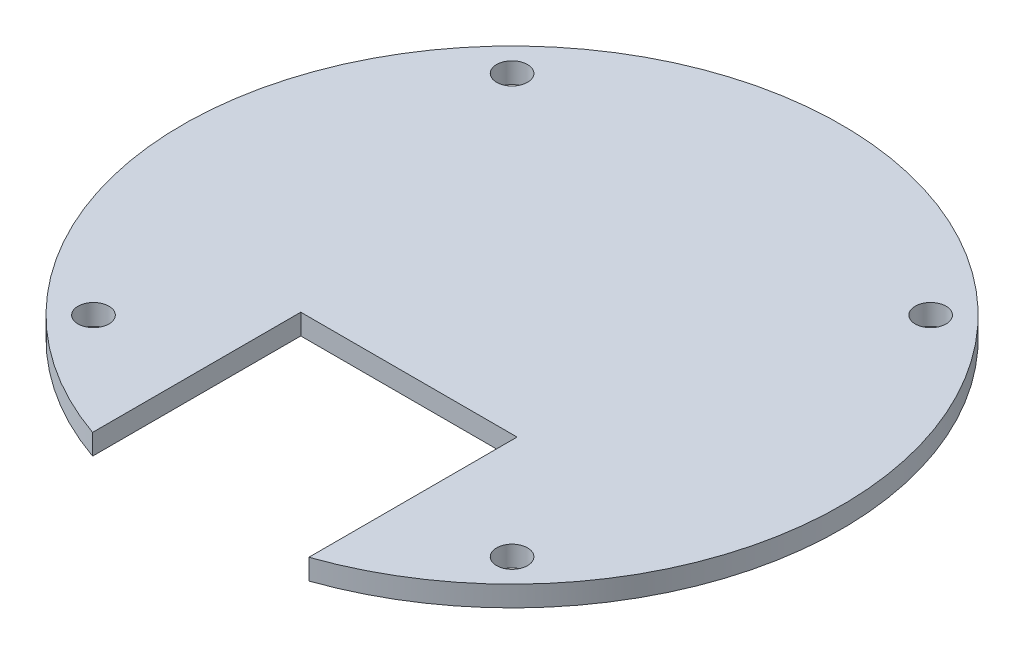
ISO-10303-21;
HEADER;
FILE_DESCRIPTION(('STEP AP214'),'2;1');
FILE_NAME('part.step','',(''),(''),'','','');
FILE_SCHEMA(('AUTOMOTIVE_DESIGN { 1 0 10303 214 1 1 1 1 }'));
ENDSEC;
DATA;
#1=APPLICATION_CONTEXT('core data for automotive mechanical design processes');
#2=APPLICATION_PROTOCOL_DEFINITION('international standard','automotive_design',2000,#1);
#3=PRODUCT_CONTEXT('',#1,'mechanical');
#4=PRODUCT('Part','Part','',(#3));
#5=PRODUCT_RELATED_PRODUCT_CATEGORY('part','',(#4));
#6=PRODUCT_DEFINITION_FORMATION('','',#4);
#7=PRODUCT_DEFINITION_CONTEXT('part definition',#1,'design');
#8=PRODUCT_DEFINITION('design','',#6,#7);
#9=PRODUCT_DEFINITION_SHAPE('','',#8);
#10=(LENGTH_UNIT() NAMED_UNIT(*) SI_UNIT(.MILLI.,.METRE.));
#11=(NAMED_UNIT(*) PLANE_ANGLE_UNIT() SI_UNIT($,.RADIAN.));
#12=(NAMED_UNIT(*) SI_UNIT($,.STERADIAN.) SOLID_ANGLE_UNIT());
#13=UNCERTAINTY_MEASURE_WITH_UNIT(LENGTH_MEASURE(1.E-05),#10,'distance_accuracy_value','');
#14=(GEOMETRIC_REPRESENTATION_CONTEXT(3) GLOBAL_UNCERTAINTY_ASSIGNED_CONTEXT((#13)) GLOBAL_UNIT_ASSIGNED_CONTEXT((#10,
#11,#12)) REPRESENTATION_CONTEXT('',''));
#15=CARTESIAN_POINT('',(0.,0.,0.));
#16=DIRECTION('',(0.,0.,1.));
#17=DIRECTION('',(1.,0.,0.));
#18=AXIS2_PLACEMENT_3D('',#15,#16,#17);
#19=CARTESIAN_POINT('',(-0.203481168123992,2.,0.219317578886269));
#20=DIRECTION('',(0.,1.,0.));
#21=DIRECTION('',(0.,0.,1.));
#22=AXIS2_PLACEMENT_3D('',#19,#20,#21);
#23=PLANE('',#22);
#24=CARTESIAN_POINT('',(-20.5242953249725,2.,-20.1014965779628));
#25=DIRECTION('',(0.,1.,0.));
#26=DIRECTION('',(0.,0.,1.));
#27=AXIS2_PLACEMENT_3D('',#24,#25,#26);
#28=CIRCLE('',#27,1.50000000000003);
#29=CARTESIAN_POINT('',(-20.5242953249725,2.,-18.6014965779627));
#30=VERTEX_POINT('',#29);
#31=EDGE_CURVE('E175',#30,#30,#28,.T.);
#32=ORIENTED_EDGE('',*,*,#31,.F.);
#33=EDGE_LOOP('',(#32));
#34=FACE_BOUND('',#33,.T.);
#35=CARTESIAN_POINT('',(20.1173329887245,2.,-20.1014965779628));
#36=DIRECTION('',(0.,-1.,0.));
#37=DIRECTION('',(0.,0.,-1.));
#38=AXIS2_PLACEMENT_3D('',#35,#36,#37);
#39=CIRCLE('',#38,1.50000000000002);
#40=CARTESIAN_POINT('',(20.1173329887245,2.,-21.6014965779628));
#41=VERTEX_POINT('',#40);
#42=EDGE_CURVE('E160',#41,#41,#39,.T.);
#43=ORIENTED_EDGE('',*,*,#42,.T.);
#44=EDGE_LOOP('',(#43));
#45=FACE_BOUND('',#44,.T.);
#46=DIRECTION('',(0.,0.,1.));
#47=VECTOR('',#46,1.);
#48=CARTESIAN_POINT('',(10.296518831876,2.,10.2340953056403));
#49=LINE('',#48,#47);
#50=CARTESIAN_POINT('',(10.296518831876,2.,10.2340953056403));
#51=VERTEX_POINT('',#50);
#52=CARTESIAN_POINT('',(10.296518831876,2.,30.4476155792699));
#53=VERTEX_POINT('',#52);
#54=EDGE_CURVE('E145',#51,#53,#49,.T.);
#55=ORIENTED_EDGE('',*,*,#54,.T.);
#56=CARTESIAN_POINT('',(-0.203481168123992,2.,0.219317578886269));
#57=DIRECTION('',(0.,1.,0.));
#58=DIRECTION('',(0.,0.,1.));
#59=AXIS2_PLACEMENT_3D('',#56,#57,#58);
#60=CIRCLE('',#59,32.);
#61=CARTESIAN_POINT('',(-10.703481168124,2.,30.4476155792699));
#62=VERTEX_POINT('',#61);
#63=EDGE_CURVE('E140',#53,#62,#60,.T.);
#64=ORIENTED_EDGE('',*,*,#63,.T.);
#65=DIRECTION('',(0.,0.,-1.));
#66=VECTOR('',#65,1.);
#67=CARTESIAN_POINT('',(-10.703481168124,2.,30.4476155792699));
#68=LINE('',#67,#66);
#69=CARTESIAN_POINT('',(-10.703481168124,2.,10.2340953056403));
#70=VERTEX_POINT('',#69);
#71=EDGE_CURVE('E143',#62,#70,#68,.T.);
#72=ORIENTED_EDGE('',*,*,#71,.T.);
#73=DIRECTION('',(1.,0.,0.));
#74=VECTOR('',#73,1.);
#75=CARTESIAN_POINT('',(-10.703481168124,2.,10.2340953056403));
#76=LINE('',#75,#74);
#77=EDGE_CURVE('E110',#70,#51,#76,.T.);
#78=ORIENTED_EDGE('',*,*,#77,.T.);
#79=EDGE_LOOP('',(#55,#64,#72,#78));
#80=FACE_BOUND('',#79,.T.);
#81=CARTESIAN_POINT('',(-20.5242953249724,2.,20.5401317357357));
#82=DIRECTION('',(0.,-1.,0.));
#83=DIRECTION('',(0.,0.,-1.));
#84=AXIS2_PLACEMENT_3D('',#81,#82,#83);
#85=CIRCLE('',#84,1.50000000000005);
#86=CARTESIAN_POINT('',(-20.5242953249724,2.,19.0401317357356));
#87=VERTEX_POINT('',#86);
#88=EDGE_CURVE('E181',#87,#87,#85,.T.);
#89=ORIENTED_EDGE('',*,*,#88,.T.);
#90=EDGE_LOOP('',(#89));
#91=FACE_BOUND('',#90,.T.);
#92=CARTESIAN_POINT('',(20.1173329887247,2.,20.5401317357354));
#93=DIRECTION('',(0.,1.,0.));
#94=DIRECTION('',(0.,0.,1.));
#95=AXIS2_PLACEMENT_3D('',#92,#93,#94);
#96=CIRCLE('',#95,1.50000000000002);
#97=CARTESIAN_POINT('',(20.1173329887247,2.,22.0401317357354));
#98=VERTEX_POINT('',#97);
#99=EDGE_CURVE('E187',#98,#98,#96,.T.);
#100=ORIENTED_EDGE('',*,*,#99,.F.);
#101=EDGE_LOOP('',(#100));
#102=FACE_BOUND('',#101,.T.);
#103=ADVANCED_FACE('F93',(#34,#45,#80,#91,#102),#23,.T.);
#104=CARTESIAN_POINT('',(-0.203481168123992,0.,0.219317578886269));
#105=DIRECTION('',(0.,1.,0.));
#106=DIRECTION('',(0.,0.,1.));
#107=AXIS2_PLACEMENT_3D('',#104,#105,#106);
#108=PLANE('',#107);
#109=CARTESIAN_POINT('',(-20.5242953249724,0.,20.5401317357357));
#110=DIRECTION('',(0.,-1.,0.));
#111=DIRECTION('',(0.,0.,-1.));
#112=AXIS2_PLACEMENT_3D('',#109,#110,#111);
#113=CIRCLE('',#112,1.50000000000005);
#114=CARTESIAN_POINT('',(-20.5242953249724,0.,19.0401317357356));
#115=VERTEX_POINT('',#114);
#116=EDGE_CURVE('E184',#115,#115,#113,.T.);
#117=ORIENTED_EDGE('',*,*,#116,.F.);
#118=EDGE_LOOP('',(#117));
#119=FACE_BOUND('',#118,.T.);
#120=CARTESIAN_POINT('',(20.1173329887245,0.,-20.1014965779628));
#121=DIRECTION('',(0.,-1.,0.));
#122=DIRECTION('',(0.,0.,-1.));
#123=AXIS2_PLACEMENT_3D('',#120,#121,#122);
#124=CIRCLE('',#123,1.50000000000002);
#125=CARTESIAN_POINT('',(20.1173329887245,0.,-21.6014965779628));
#126=VERTEX_POINT('',#125);
#127=EDGE_CURVE('E172',#126,#126,#124,.T.);
#128=ORIENTED_EDGE('',*,*,#127,.F.);
#129=EDGE_LOOP('',(#128));
#130=FACE_BOUND('',#129,.T.);
#131=DIRECTION('',(0.,0.,1.));
#132=VECTOR('',#131,1.);
#133=CARTESIAN_POINT('',(10.296518831876,0.,10.2340953056403));
#134=LINE('',#133,#132);
#135=CARTESIAN_POINT('',(10.296518831876,0.,10.2340953056403));
#136=VERTEX_POINT('',#135);
#137=CARTESIAN_POINT('',(10.296518831876,0.,30.4476155792699));
#138=VERTEX_POINT('',#137);
#139=EDGE_CURVE('E157',#136,#138,#134,.T.);
#140=ORIENTED_EDGE('',*,*,#139,.F.);
#141=DIRECTION('',(1.,0.,0.));
#142=VECTOR('',#141,1.);
#143=CARTESIAN_POINT('',(-10.703481168124,0.,10.2340953056403));
#144=LINE('',#143,#142);
#145=CARTESIAN_POINT('',(-10.703481168124,0.,10.2340953056403));
#146=VERTEX_POINT('',#145);
#147=EDGE_CURVE('E133',#146,#136,#144,.T.);
#148=ORIENTED_EDGE('',*,*,#147,.F.);
#149=DIRECTION('',(0.,0.,-1.));
#150=VECTOR('',#149,1.);
#151=CARTESIAN_POINT('',(-10.703481168124,0.,30.4476155792699));
#152=LINE('',#151,#150);
#153=CARTESIAN_POINT('',(-10.703481168124,0.,30.4476155792699));
#154=VERTEX_POINT('',#153);
#155=EDGE_CURVE('E127',#154,#146,#152,.T.);
#156=ORIENTED_EDGE('',*,*,#155,.F.);
#157=CARTESIAN_POINT('',(-0.203481168123992,0.,0.219317578886269));
#158=DIRECTION('',(0.,1.,0.));
#159=DIRECTION('',(0.,0.,1.));
#160=AXIS2_PLACEMENT_3D('',#157,#158,#159);
#161=CIRCLE('',#160,32.);
#162=EDGE_CURVE('E149',#138,#154,#161,.T.);
#163=ORIENTED_EDGE('',*,*,#162,.F.);
#164=EDGE_LOOP('',(#140,#148,#156,#163));
#165=FACE_BOUND('',#164,.T.);
#166=CARTESIAN_POINT('',(-20.5242953249725,0.,-20.1014965779628));
#167=DIRECTION('',(0.,1.,0.));
#168=DIRECTION('',(0.,0.,1.));
#169=AXIS2_PLACEMENT_3D('',#166,#167,#168);
#170=CIRCLE('',#169,1.50000000000003);
#171=CARTESIAN_POINT('',(-20.5242953249725,0.,-18.6014965779627));
#172=VERTEX_POINT('',#171);
#173=EDGE_CURVE('E178',#172,#172,#170,.T.);
#174=ORIENTED_EDGE('',*,*,#173,.T.);
#175=EDGE_LOOP('',(#174));
#176=FACE_BOUND('',#175,.T.);
#177=CARTESIAN_POINT('',(20.1173329887247,0.,20.5401317357354));
#178=DIRECTION('',(0.,1.,0.));
#179=DIRECTION('',(0.,0.,1.));
#180=AXIS2_PLACEMENT_3D('',#177,#178,#179);
#181=CIRCLE('',#180,1.50000000000002);
#182=CARTESIAN_POINT('',(20.1173329887247,0.,22.0401317357354));
#183=VERTEX_POINT('',#182);
#184=EDGE_CURVE('E190',#183,#183,#181,.T.);
#185=ORIENTED_EDGE('',*,*,#184,.T.);
#186=EDGE_LOOP('',(#185));
#187=FACE_BOUND('',#186,.T.);
#188=ADVANCED_FACE('F168',(#119,#130,#165,#176,#187),#108,.F.);
#189=CARTESIAN_POINT('',(10.296518831876,2.,10.2340953056403));
#190=DIRECTION('',(1.,0.,0.));
#191=DIRECTION('',(0.,0.,-1.));
#192=AXIS2_PLACEMENT_3D('',#189,#190,#191);
#193=PLANE('',#192);
#194=ORIENTED_EDGE('',*,*,#139,.T.);
#195=DIRECTION('',(0.,-1.,0.));
#196=VECTOR('',#195,1.);
#197=CARTESIAN_POINT('',(10.296518831876,2.,30.4476155792699));
#198=LINE('',#197,#196);
#199=EDGE_CURVE('E12',#53,#138,#198,.T.);
#200=ORIENTED_EDGE('',*,*,#199,.F.);
#201=ORIENTED_EDGE('',*,*,#54,.F.);
#202=DIRECTION('',(0.,-1.,0.));
#203=VECTOR('',#202,1.);
#204=CARTESIAN_POINT('',(10.296518831876,2.,10.2340953056403));
#205=LINE('',#204,#203);
#206=EDGE_CURVE('E153',#51,#136,#205,.T.);
#207=ORIENTED_EDGE('',*,*,#206,.T.);
#208=EDGE_LOOP('',(#194,#200,#201,#207));
#209=FACE_BOUND('',#208,.T.);
#210=ADVANCED_FACE('F95',(#209),#193,.F.);
#211=CARTESIAN_POINT('',(-0.203481168123992,2.,0.219317578886269));
#212=DIRECTION('',(0.,-1.,0.));
#213=DIRECTION('',(0.,0.,-1.));
#214=AXIS2_PLACEMENT_3D('',#211,#212,#213);
#215=CYLINDRICAL_SURFACE('',#214,32.);
#216=ORIENTED_EDGE('',*,*,#162,.T.);
#217=DIRECTION('',(0.,-1.,0.));
#218=VECTOR('',#217,1.);
#219=CARTESIAN_POINT('',(-10.703481168124,2.,30.4476155792699));
#220=LINE('',#219,#218);
#221=EDGE_CURVE('E102',#62,#154,#220,.T.);
#222=ORIENTED_EDGE('',*,*,#221,.F.);
#223=ORIENTED_EDGE('',*,*,#63,.F.);
#224=ORIENTED_EDGE('',*,*,#199,.T.);
#225=EDGE_LOOP('',(#216,#222,#223,#224));
#226=FACE_BOUND('',#225,.T.);
#227=ADVANCED_FACE('F148',(#226),#215,.T.);
#228=CARTESIAN_POINT('',(-10.703481168124,2.,30.4476155792699));
#229=DIRECTION('',(-1.,0.,0.));
#230=DIRECTION('',(0.,0.,1.));
#231=AXIS2_PLACEMENT_3D('',#228,#229,#230);
#232=PLANE('',#231);
#233=ORIENTED_EDGE('',*,*,#155,.T.);
#234=DIRECTION('',(0.,-1.,0.));
#235=VECTOR('',#234,1.);
#236=CARTESIAN_POINT('',(-10.703481168124,2.,10.2340953056403));
#237=LINE('',#236,#235);
#238=EDGE_CURVE('E150',#70,#146,#237,.T.);
#239=ORIENTED_EDGE('',*,*,#238,.F.);
#240=ORIENTED_EDGE('',*,*,#71,.F.);
#241=ORIENTED_EDGE('',*,*,#221,.T.);
#242=EDGE_LOOP('',(#233,#239,#240,#241));
#243=FACE_BOUND('',#242,.T.);
#244=ADVANCED_FACE('F151',(#243),#232,.F.);
#245=CARTESIAN_POINT('',(-10.703481168124,2.,10.2340953056403));
#246=DIRECTION('',(0.,0.,-1.));
#247=DIRECTION('',(-1.,0.,0.));
#248=AXIS2_PLACEMENT_3D('',#245,#246,#247);
#249=PLANE('',#248);
#250=ORIENTED_EDGE('',*,*,#147,.T.);
#251=ORIENTED_EDGE('',*,*,#206,.F.);
#252=ORIENTED_EDGE('',*,*,#77,.F.);
#253=ORIENTED_EDGE('',*,*,#238,.T.);
#254=EDGE_LOOP('',(#250,#251,#252,#253));
#255=FACE_BOUND('',#254,.T.);
#256=ADVANCED_FACE('F165',(#255),#249,.F.);
#257=CARTESIAN_POINT('',(20.1173329887245,2.,-20.1014965779628));
#258=DIRECTION('',(0.,-1.,0.));
#259=DIRECTION('',(0.,0.,-1.));
#260=AXIS2_PLACEMENT_3D('',#257,#258,#259);
#261=CYLINDRICAL_SURFACE('',#260,1.50000000000002);
#262=ORIENTED_EDGE('',*,*,#42,.F.);
#263=EDGE_LOOP('',(#262));
#264=FACE_BOUND('',#263,.T.);
#265=ORIENTED_EDGE('',*,*,#127,.T.);
#266=EDGE_LOOP('',(#265));
#267=FACE_BOUND('',#266,.T.);
#268=ADVANCED_FACE('F210',(#264,#267),#261,.F.);
#269=CARTESIAN_POINT('',(-20.5242953249725,2.,-20.1014965779628));
#270=DIRECTION('',(0.,-1.,0.));
#271=DIRECTION('',(0.,0.,-1.));
#272=AXIS2_PLACEMENT_3D('',#269,#270,#271);
#273=CYLINDRICAL_SURFACE('',#272,1.50000000000003);
#274=ORIENTED_EDGE('',*,*,#31,.T.);
#275=EDGE_LOOP('',(#274));
#276=FACE_BOUND('',#275,.T.);
#277=ORIENTED_EDGE('',*,*,#173,.F.);
#278=EDGE_LOOP('',(#277));
#279=FACE_BOUND('',#278,.T.);
#280=ADVANCED_FACE('F256',(#276,#279),#273,.F.);
#281=CARTESIAN_POINT('',(-20.5242953249724,2.,20.5401317357357));
#282=DIRECTION('',(0.,-1.,0.));
#283=DIRECTION('',(0.,0.,-1.));
#284=AXIS2_PLACEMENT_3D('',#281,#282,#283);
#285=CYLINDRICAL_SURFACE('',#284,1.50000000000005);
#286=ORIENTED_EDGE('',*,*,#88,.F.);
#287=EDGE_LOOP('',(#286));
#288=FACE_BOUND('',#287,.T.);
#289=ORIENTED_EDGE('',*,*,#116,.T.);
#290=EDGE_LOOP('',(#289));
#291=FACE_BOUND('',#290,.T.);
#292=ADVANCED_FACE('F264',(#288,#291),#285,.F.);
#293=CARTESIAN_POINT('',(20.1173329887247,2.,20.5401317357354));
#294=DIRECTION('',(0.,-1.,0.));
#295=DIRECTION('',(0.,0.,-1.));
#296=AXIS2_PLACEMENT_3D('',#293,#294,#295);
#297=CYLINDRICAL_SURFACE('',#296,1.50000000000002);
#298=ORIENTED_EDGE('',*,*,#99,.T.);
#299=EDGE_LOOP('',(#298));
#300=FACE_BOUND('',#299,.T.);
#301=ORIENTED_EDGE('',*,*,#184,.F.);
#302=EDGE_LOOP('',(#301));
#303=FACE_BOUND('',#302,.T.);
#304=ADVANCED_FACE('F196',(#300,#303),#297,.F.);
#305=CLOSED_SHELL('',(#103,#188,#210,#227,#244,#256,#268,#280,#292,#304));
#306=MANIFOLD_SOLID_BREP('B2',#305);
#307=ADVANCED_BREP_SHAPE_REPRESENTATION('',(#18,#306),#14);
#308=SHAPE_DEFINITION_REPRESENTATION(#9,#307);
ENDSEC;
END-ISO-10303-21;
